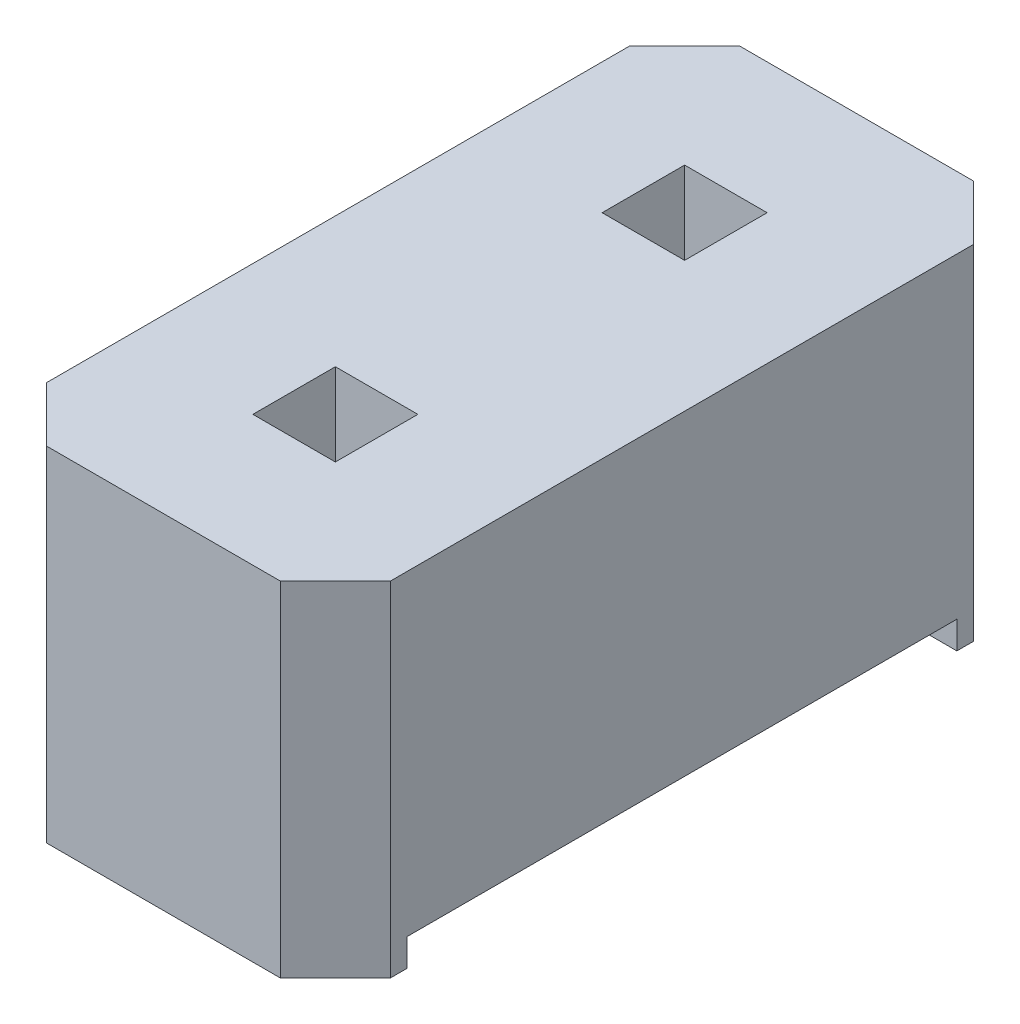
ISO-10303-21;
HEADER;
FILE_DESCRIPTION(('STEP AP214'),'2;1');
FILE_NAME('part.step','',(''),(''),'','','');
FILE_SCHEMA(('AUTOMOTIVE_DESIGN { 1 0 10303 214 1 1 1 1 }'));
ENDSEC;
DATA;
#1=APPLICATION_CONTEXT('core data for automotive mechanical design processes');
#2=APPLICATION_PROTOCOL_DEFINITION('international standard','automotive_design',2000,#1);
#3=PRODUCT_CONTEXT('',#1,'mechanical');
#4=PRODUCT('Part','Part','',(#3));
#5=PRODUCT_RELATED_PRODUCT_CATEGORY('part','',(#4));
#6=PRODUCT_DEFINITION_FORMATION('','',#4);
#7=PRODUCT_DEFINITION_CONTEXT('part definition',#1,'design');
#8=PRODUCT_DEFINITION('design','',#6,#7);
#9=PRODUCT_DEFINITION_SHAPE('','',#8);
#10=(LENGTH_UNIT() NAMED_UNIT(*) SI_UNIT(.MILLI.,.METRE.));
#11=(NAMED_UNIT(*) PLANE_ANGLE_UNIT() SI_UNIT($,.RADIAN.));
#12=(NAMED_UNIT(*) SI_UNIT($,.STERADIAN.) SOLID_ANGLE_UNIT());
#13=UNCERTAINTY_MEASURE_WITH_UNIT(LENGTH_MEASURE(1.E-05),#10,'distance_accuracy_value','');
#14=(GEOMETRIC_REPRESENTATION_CONTEXT(3) GLOBAL_UNCERTAINTY_ASSIGNED_CONTEXT((#13)) GLOBAL_UNIT_ASSIGNED_CONTEXT((#10,
#11,#12)) REPRESENTATION_CONTEXT('',''));
#15=CARTESIAN_POINT('',(0.,0.,0.));
#16=DIRECTION('',(0.,0.,1.));
#17=DIRECTION('',(1.,0.,0.));
#18=AXIS2_PLACEMENT_3D('',#15,#16,#17);
#19=CARTESIAN_POINT('',(0.,0.,0.));
#20=DIRECTION('',(0.,-1.,0.));
#21=DIRECTION('',(0.,0.,-1.));
#22=AXIS2_PLACEMENT_3D('',#19,#20,#21);
#23=PLANE('',#22);
#24=DIRECTION('',(-1.,0.,0.));
#25=VECTOR('',#24,1.);
#26=CARTESIAN_POINT('',(0.,0.,2.));
#27=LINE('',#26,#25);
#28=CARTESIAN_POINT('',(1.25,0.,2.));
#29=VERTEX_POINT('',#28);
#30=CARTESIAN_POINT('',(-1.25,0.,2.));
#31=VERTEX_POINT('',#30);
#32=EDGE_CURVE('E340',#29,#31,#27,.T.);
#33=ORIENTED_EDGE('',*,*,#32,.F.);
#34=DIRECTION('',(0.,0.,-1.));
#35=VECTOR('',#34,1.);
#36=CARTESIAN_POINT('',(1.25,0.,2.12));
#37=LINE('',#36,#35);
#38=CARTESIAN_POINT('',(1.25,0.,2.12));
#39=VERTEX_POINT('',#38);
#40=EDGE_CURVE('E190',#39,#29,#37,.T.);
#41=ORIENTED_EDGE('',*,*,#40,.F.);
#42=DIRECTION('',(0.707106781186547,0.,-0.707106781186548));
#43=VECTOR('',#42,1.);
#44=CARTESIAN_POINT('',(0.850000000000001,0.,2.52));
#45=LINE('',#44,#43);
#46=CARTESIAN_POINT('',(0.850000000000001,0.,2.52));
#47=VERTEX_POINT('',#46);
#48=EDGE_CURVE('E201',#47,#39,#45,.T.);
#49=ORIENTED_EDGE('',*,*,#48,.F.);
#50=DIRECTION('',(1.,0.,0.));
#51=VECTOR('',#50,1.);
#52=CARTESIAN_POINT('',(-0.85,0.,2.52));
#53=LINE('',#52,#51);
#54=CARTESIAN_POINT('',(-0.85,0.,2.52));
#55=VERTEX_POINT('',#54);
#56=EDGE_CURVE('E307',#55,#47,#53,.T.);
#57=ORIENTED_EDGE('',*,*,#56,.F.);
#58=DIRECTION('',(0.707106781186547,0.,0.707106781186548));
#59=VECTOR('',#58,1.);
#60=CARTESIAN_POINT('',(-1.25,0.,2.12));
#61=LINE('',#60,#59);
#62=CARTESIAN_POINT('',(-1.25,0.,2.12));
#63=VERTEX_POINT('',#62);
#64=EDGE_CURVE('E306',#63,#55,#61,.T.);
#65=ORIENTED_EDGE('',*,*,#64,.F.);
#66=DIRECTION('',(0.,0.,1.));
#67=VECTOR('',#66,1.);
#68=CARTESIAN_POINT('',(-1.25,0.,2.12));
#69=LINE('',#68,#67);
#70=EDGE_CURVE('E287',#31,#63,#69,.T.);
#71=ORIENTED_EDGE('',*,*,#70,.F.);
#72=EDGE_LOOP('',(#33,#41,#49,#57,#65,#71));
#73=FACE_BOUND('',#72,.T.);
#74=ADVANCED_FACE('F33',(#73),#23,.T.);
#75=CARTESIAN_POINT('',(0.,2.5,0.));
#76=DIRECTION('',(0.,-1.,0.));
#77=DIRECTION('',(0.,0.,-1.));
#78=AXIS2_PLACEMENT_3D('',#75,#76,#77);
#79=PLANE('',#78);
#80=DIRECTION('',(0.,0.,1.));
#81=VECTOR('',#80,1.);
#82=CARTESIAN_POINT('',(-0.3,2.5,0.97));
#83=LINE('',#82,#81);
#84=CARTESIAN_POINT('',(-0.3,2.5,0.97));
#85=VERTEX_POINT('',#84);
#86=CARTESIAN_POINT('',(-0.3,2.5,1.57));
#87=VERTEX_POINT('',#86);
#88=EDGE_CURVE('E266',#85,#87,#83,.T.);
#89=ORIENTED_EDGE('',*,*,#88,.F.);
#90=DIRECTION('',(-1.,0.,0.));
#91=VECTOR('',#90,1.);
#92=CARTESIAN_POINT('',(0.3,2.5,0.97));
#93=LINE('',#92,#91);
#94=CARTESIAN_POINT('',(0.3,2.5,0.97));
#95=VERTEX_POINT('',#94);
#96=EDGE_CURVE('E273',#95,#85,#93,.T.);
#97=ORIENTED_EDGE('',*,*,#96,.F.);
#98=DIRECTION('',(0.,0.,-1.));
#99=VECTOR('',#98,1.);
#100=CARTESIAN_POINT('',(0.3,2.5,0.97));
#101=LINE('',#100,#99);
#102=CARTESIAN_POINT('',(0.3,2.5,1.57));
#103=VERTEX_POINT('',#102);
#104=EDGE_CURVE('E270',#103,#95,#101,.T.);
#105=ORIENTED_EDGE('',*,*,#104,.F.);
#106=DIRECTION('',(1.,0.,0.));
#107=VECTOR('',#106,1.);
#108=CARTESIAN_POINT('',(0.3,2.5,1.57));
#109=LINE('',#108,#107);
#110=EDGE_CURVE('E268',#87,#103,#109,.T.);
#111=ORIENTED_EDGE('',*,*,#110,.F.);
#112=EDGE_LOOP('',(#89,#97,#105,#111));
#113=FACE_BOUND('',#112,.T.);
#114=DIRECTION('',(0.,0.,1.));
#115=VECTOR('',#114,1.);
#116=CARTESIAN_POINT('',(-1.25,2.5,2.12));
#117=LINE('',#116,#115);
#118=CARTESIAN_POINT('',(-1.25,2.5,-2.12));
#119=VERTEX_POINT('',#118);
#120=CARTESIAN_POINT('',(-1.25,2.5,2.12));
#121=VERTEX_POINT('',#120);
#122=EDGE_CURVE('E208',#119,#121,#117,.T.);
#123=ORIENTED_EDGE('',*,*,#122,.T.);
#124=DIRECTION('',(0.707106781186547,0.,0.707106781186548));
#125=VECTOR('',#124,1.);
#126=CARTESIAN_POINT('',(-1.25,2.5,2.12));
#127=LINE('',#126,#125);
#128=CARTESIAN_POINT('',(-0.85,2.5,2.52));
#129=VERTEX_POINT('',#128);
#130=EDGE_CURVE('E290',#121,#129,#127,.T.);
#131=ORIENTED_EDGE('',*,*,#130,.T.);
#132=DIRECTION('',(1.,0.,0.));
#133=VECTOR('',#132,1.);
#134=CARTESIAN_POINT('',(-0.85,2.5,2.52));
#135=LINE('',#134,#133);
#136=CARTESIAN_POINT('',(0.850000000000001,2.5,2.52));
#137=VERTEX_POINT('',#136);
#138=EDGE_CURVE('E292',#129,#137,#135,.T.);
#139=ORIENTED_EDGE('',*,*,#138,.T.);
#140=DIRECTION('',(0.707106781186547,0.,-0.707106781186548));
#141=VECTOR('',#140,1.);
#142=CARTESIAN_POINT('',(0.850000000000001,2.5,2.52));
#143=LINE('',#142,#141);
#144=CARTESIAN_POINT('',(1.25,2.5,2.12));
#145=VERTEX_POINT('',#144);
#146=EDGE_CURVE('E294',#137,#145,#143,.T.);
#147=ORIENTED_EDGE('',*,*,#146,.T.);
#148=DIRECTION('',(0.,0.,-1.));
#149=VECTOR('',#148,1.);
#150=CARTESIAN_POINT('',(1.25,2.5,2.12));
#151=LINE('',#150,#149);
#152=CARTESIAN_POINT('',(1.25,2.5,-2.12));
#153=VERTEX_POINT('',#152);
#154=EDGE_CURVE('E296',#145,#153,#151,.T.);
#155=ORIENTED_EDGE('',*,*,#154,.T.);
#156=DIRECTION('',(-0.707106781186547,0.,-0.707106781186548));
#157=VECTOR('',#156,1.);
#158=CARTESIAN_POINT('',(0.85,2.5,-2.52));
#159=LINE('',#158,#157);
#160=CARTESIAN_POINT('',(0.85,2.5,-2.52));
#161=VERTEX_POINT('',#160);
#162=EDGE_CURVE('E298',#153,#161,#159,.T.);
#163=ORIENTED_EDGE('',*,*,#162,.T.);
#164=DIRECTION('',(-1.,0.,0.));
#165=VECTOR('',#164,1.);
#166=CARTESIAN_POINT('',(-0.85,2.5,-2.52));
#167=LINE('',#166,#165);
#168=CARTESIAN_POINT('',(-0.85,2.5,-2.52));
#169=VERTEX_POINT('',#168);
#170=EDGE_CURVE('E300',#161,#169,#167,.T.);
#171=ORIENTED_EDGE('',*,*,#170,.T.);
#172=DIRECTION('',(-0.707106781186547,0.,0.707106781186548));
#173=VECTOR('',#172,1.);
#174=CARTESIAN_POINT('',(-1.25,2.5,-2.12));
#175=LINE('',#174,#173);
#176=EDGE_CURVE('E213',#169,#119,#175,.T.);
#177=ORIENTED_EDGE('',*,*,#176,.T.);
#178=EDGE_LOOP('',(#123,#131,#139,#147,#155,#163,#171,#177));
#179=FACE_BOUND('',#178,.T.);
#180=DIRECTION('',(1.,0.,0.));
#181=VECTOR('',#180,1.);
#182=CARTESIAN_POINT('',(0.3,2.5,-0.97));
#183=LINE('',#182,#181);
#184=CARTESIAN_POINT('',(-0.3,2.5,-0.97));
#185=VERTEX_POINT('',#184);
#186=CARTESIAN_POINT('',(0.3,2.5,-0.97));
#187=VERTEX_POINT('',#186);
#188=EDGE_CURVE('E342',#185,#187,#183,.T.);
#189=ORIENTED_EDGE('',*,*,#188,.F.);
#190=DIRECTION('',(0.,0.,1.));
#191=VECTOR('',#190,1.);
#192=CARTESIAN_POINT('',(-0.3,2.5,-0.97));
#193=LINE('',#192,#191);
#194=CARTESIAN_POINT('',(-0.3,2.5,-1.57));
#195=VERTEX_POINT('',#194);
#196=EDGE_CURVE('E254',#195,#185,#193,.T.);
#197=ORIENTED_EDGE('',*,*,#196,.F.);
#198=DIRECTION('',(-1.,0.,0.));
#199=VECTOR('',#198,1.);
#200=CARTESIAN_POINT('',(0.3,2.5,-1.57));
#201=LINE('',#200,#199);
#202=CARTESIAN_POINT('',(0.3,2.5,-1.57));
#203=VERTEX_POINT('',#202);
#204=EDGE_CURVE('E259',#203,#195,#201,.T.);
#205=ORIENTED_EDGE('',*,*,#204,.F.);
#206=DIRECTION('',(0.,0.,-1.));
#207=VECTOR('',#206,1.);
#208=CARTESIAN_POINT('',(0.3,2.5,-0.97));
#209=LINE('',#208,#207);
#210=EDGE_CURVE('E344',#187,#203,#209,.T.);
#211=ORIENTED_EDGE('',*,*,#210,.F.);
#212=EDGE_LOOP('',(#189,#197,#205,#211));
#213=FACE_BOUND('',#212,.T.);
#214=ADVANCED_FACE('F352',(#113,#179,#213),#79,.F.);
#215=DIRECTION('',(1.,0.,0.));
#216=VECTOR('',#215,1.);
#217=CARTESIAN_POINT('',(0.,0.,-2.));
#218=LINE('',#217,#216);
#219=CARTESIAN_POINT('',(-1.25,0.,-2.));
#220=VERTEX_POINT('',#219);
#221=CARTESIAN_POINT('',(1.25,0.,-2.));
#222=VERTEX_POINT('',#221);
#223=EDGE_CURVE('E338',#220,#222,#218,.T.);
#224=ORIENTED_EDGE('',*,*,#223,.F.);
#225=CARTESIAN_POINT('',(-1.25,0.,-2.12));
#226=VERTEX_POINT('',#225);
#227=EDGE_CURVE('E303',#226,#220,#69,.T.);
#228=ORIENTED_EDGE('',*,*,#227,.F.);
#229=DIRECTION('',(-0.707106781186547,0.,0.707106781186548));
#230=VECTOR('',#229,1.);
#231=CARTESIAN_POINT('',(-1.25,0.,-2.12));
#232=LINE('',#231,#230);
#233=CARTESIAN_POINT('',(-0.85,0.,-2.52));
#234=VERTEX_POINT('',#233);
#235=EDGE_CURVE('E206',#234,#226,#232,.T.);
#236=ORIENTED_EDGE('',*,*,#235,.F.);
#237=DIRECTION('',(-1.,0.,0.));
#238=VECTOR('',#237,1.);
#239=CARTESIAN_POINT('',(-0.85,0.,-2.52));
#240=LINE('',#239,#238);
#241=CARTESIAN_POINT('',(0.85,0.,-2.52));
#242=VERTEX_POINT('',#241);
#243=EDGE_CURVE('E199',#242,#234,#240,.T.);
#244=ORIENTED_EDGE('',*,*,#243,.F.);
#245=DIRECTION('',(-0.707106781186547,0.,-0.707106781186548));
#246=VECTOR('',#245,1.);
#247=CARTESIAN_POINT('',(0.85,0.,-2.52));
#248=LINE('',#247,#246);
#249=CARTESIAN_POINT('',(1.25,0.,-2.12));
#250=VERTEX_POINT('',#249);
#251=EDGE_CURVE('E196',#250,#242,#248,.T.);
#252=ORIENTED_EDGE('',*,*,#251,.F.);
#253=EDGE_CURVE('E197',#222,#250,#37,.T.);
#254=ORIENTED_EDGE('',*,*,#253,.F.);
#255=EDGE_LOOP('',(#224,#228,#236,#244,#252,#254));
#256=FACE_BOUND('',#255,.T.);
#257=ADVANCED_FACE('F366',(#256),#23,.T.);
#258=CARTESIAN_POINT('',(-1.25,2.5,2.12));
#259=DIRECTION('',(1.,0.,0.));
#260=DIRECTION('',(0.,0.,-1.));
#261=AXIS2_PLACEMENT_3D('',#258,#259,#260);
#262=PLANE('',#261);
#263=DIRECTION('',(0.,0.,-1.));
#264=VECTOR('',#263,1.);
#265=CARTESIAN_POINT('',(-1.25,0.2,-2.));
#266=LINE('',#265,#264);
#267=CARTESIAN_POINT('',(-1.25,0.2,2.));
#268=VERTEX_POINT('',#267);
#269=CARTESIAN_POINT('',(-1.25,0.2,-2.));
#270=VERTEX_POINT('',#269);
#271=EDGE_CURVE('E323',#268,#270,#266,.T.);
#272=ORIENTED_EDGE('',*,*,#271,.F.);
#273=DIRECTION('',(0.,1.,0.));
#274=VECTOR('',#273,1.);
#275=CARTESIAN_POINT('',(-1.25,-0.2,2.));
#276=LINE('',#275,#274);
#277=EDGE_CURVE('E174',#31,#268,#276,.T.);
#278=ORIENTED_EDGE('',*,*,#277,.F.);
#279=ORIENTED_EDGE('',*,*,#70,.T.);
#280=DIRECTION('',(0.,-1.,0.));
#281=VECTOR('',#280,1.);
#282=CARTESIAN_POINT('',(-1.25,2.5,2.12));
#283=LINE('',#282,#281);
#284=EDGE_CURVE('E229',#121,#63,#283,.T.);
#285=ORIENTED_EDGE('',*,*,#284,.F.);
#286=ORIENTED_EDGE('',*,*,#122,.F.);
#287=DIRECTION('',(0.,-1.,0.));
#288=VECTOR('',#287,1.);
#289=CARTESIAN_POINT('',(-1.25,2.5,-2.12));
#290=LINE('',#289,#288);
#291=EDGE_CURVE('E209',#119,#226,#290,.T.);
#292=ORIENTED_EDGE('',*,*,#291,.T.);
#293=ORIENTED_EDGE('',*,*,#227,.T.);
#294=DIRECTION('',(0.,-1.,0.));
#295=VECTOR('',#294,1.);
#296=CARTESIAN_POINT('',(-1.25,-0.2,-2.));
#297=LINE('',#296,#295);
#298=EDGE_CURVE('E184',#270,#220,#297,.T.);
#299=ORIENTED_EDGE('',*,*,#298,.F.);
#300=EDGE_LOOP('',(#272,#278,#279,#285,#286,#292,#293,#299));
#301=FACE_BOUND('',#300,.T.);
#302=ADVANCED_FACE('F35',(#301),#262,.F.);
#303=CARTESIAN_POINT('',(-1.25,2.5,2.12));
#304=DIRECTION('',(0.707106781186548,0.,-0.707106781186547));
#305=DIRECTION('',(-0.707106781186547,0.,-0.707106781186548));
#306=AXIS2_PLACEMENT_3D('',#303,#304,#305);
#307=PLANE('',#306);
#308=ORIENTED_EDGE('',*,*,#64,.T.);
#309=DIRECTION('',(0.,-1.,0.));
#310=VECTOR('',#309,1.);
#311=CARTESIAN_POINT('',(-0.85,2.5,2.52));
#312=LINE('',#311,#310);
#313=EDGE_CURVE('E226',#129,#55,#312,.T.);
#314=ORIENTED_EDGE('',*,*,#313,.F.);
#315=ORIENTED_EDGE('',*,*,#130,.F.);
#316=ORIENTED_EDGE('',*,*,#284,.T.);
#317=EDGE_LOOP('',(#308,#314,#315,#316));
#318=FACE_BOUND('',#317,.T.);
#319=ADVANCED_FACE('F319',(#318),#307,.F.);
#320=CARTESIAN_POINT('',(-0.85,2.5,2.52));
#321=DIRECTION('',(0.,0.,-1.));
#322=DIRECTION('',(-1.,0.,0.));
#323=AXIS2_PLACEMENT_3D('',#320,#321,#322);
#324=PLANE('',#323);
#325=ORIENTED_EDGE('',*,*,#56,.T.);
#326=DIRECTION('',(0.,-1.,0.));
#327=VECTOR('',#326,1.);
#328=CARTESIAN_POINT('',(0.850000000000001,2.5,2.52));
#329=LINE('',#328,#327);
#330=EDGE_CURVE('E223',#137,#47,#329,.T.);
#331=ORIENTED_EDGE('',*,*,#330,.F.);
#332=ORIENTED_EDGE('',*,*,#138,.F.);
#333=ORIENTED_EDGE('',*,*,#313,.T.);
#334=EDGE_LOOP('',(#325,#331,#332,#333));
#335=FACE_BOUND('',#334,.T.);
#336=ADVANCED_FACE('F399',(#335),#324,.F.);
#337=CARTESIAN_POINT('',(0.850000000000001,2.5,2.52));
#338=DIRECTION('',(-0.707106781186548,0.,-0.707106781186547));
#339=DIRECTION('',(-0.707106781186547,0.,0.707106781186548));
#340=AXIS2_PLACEMENT_3D('',#337,#338,#339);
#341=PLANE('',#340);
#342=ORIENTED_EDGE('',*,*,#48,.T.);
#343=DIRECTION('',(0.,-1.,0.));
#344=VECTOR('',#343,1.);
#345=CARTESIAN_POINT('',(1.25,2.5,2.12));
#346=LINE('',#345,#344);
#347=EDGE_CURVE('E193',#145,#39,#346,.T.);
#348=ORIENTED_EDGE('',*,*,#347,.F.);
#349=ORIENTED_EDGE('',*,*,#146,.F.);
#350=ORIENTED_EDGE('',*,*,#330,.T.);
#351=EDGE_LOOP('',(#342,#348,#349,#350));
#352=FACE_BOUND('',#351,.T.);
#353=ADVANCED_FACE('F312',(#352),#341,.F.);
#354=CARTESIAN_POINT('',(1.25,2.5,2.12));
#355=DIRECTION('',(-1.,0.,0.));
#356=DIRECTION('',(0.,0.,1.));
#357=AXIS2_PLACEMENT_3D('',#354,#355,#356);
#358=PLANE('',#357);
#359=ORIENTED_EDGE('',*,*,#40,.T.);
#360=DIRECTION('',(0.,1.,0.));
#361=VECTOR('',#360,1.);
#362=CARTESIAN_POINT('',(1.25,2.5,2.));
#363=LINE('',#362,#361);
#364=CARTESIAN_POINT('',(1.25,0.2,2.));
#365=VERTEX_POINT('',#364);
#366=EDGE_CURVE('E11',#29,#365,#363,.T.);
#367=ORIENTED_EDGE('',*,*,#366,.T.);
#368=DIRECTION('',(0.,0.,-1.));
#369=VECTOR('',#368,1.);
#370=CARTESIAN_POINT('',(1.25,0.2,-2.));
#371=LINE('',#370,#369);
#372=CARTESIAN_POINT('',(1.25,0.2,-2.));
#373=VERTEX_POINT('',#372);
#374=EDGE_CURVE('E181',#365,#373,#371,.T.);
#375=ORIENTED_EDGE('',*,*,#374,.T.);
#376=DIRECTION('',(0.,-1.,0.));
#377=VECTOR('',#376,1.);
#378=CARTESIAN_POINT('',(1.25,-0.2,-2.));
#379=LINE('',#378,#377);
#380=EDGE_CURVE('E48',#373,#222,#379,.T.);
#381=ORIENTED_EDGE('',*,*,#380,.T.);
#382=ORIENTED_EDGE('',*,*,#253,.T.);
#383=DIRECTION('',(0.,-1.,0.));
#384=VECTOR('',#383,1.);
#385=CARTESIAN_POINT('',(1.25,2.5,-2.12));
#386=LINE('',#385,#384);
#387=EDGE_CURVE('E219',#153,#250,#386,.T.);
#388=ORIENTED_EDGE('',*,*,#387,.F.);
#389=ORIENTED_EDGE('',*,*,#154,.F.);
#390=ORIENTED_EDGE('',*,*,#347,.T.);
#391=EDGE_LOOP('',(#359,#367,#375,#381,#382,#388,#389,#390));
#392=FACE_BOUND('',#391,.T.);
#393=ADVANCED_FACE('F187',(#392),#358,.F.);
#394=CARTESIAN_POINT('',(0.85,2.5,-2.52));
#395=DIRECTION('',(-0.707106781186548,0.,0.707106781186547));
#396=DIRECTION('',(0.707106781186547,0.,0.707106781186548));
#397=AXIS2_PLACEMENT_3D('',#394,#395,#396);
#398=PLANE('',#397);
#399=ORIENTED_EDGE('',*,*,#251,.T.);
#400=DIRECTION('',(0.,-1.,0.));
#401=VECTOR('',#400,1.);
#402=CARTESIAN_POINT('',(0.85,2.5,-2.52));
#403=LINE('',#402,#401);
#404=EDGE_CURVE('E216',#161,#242,#403,.T.);
#405=ORIENTED_EDGE('',*,*,#404,.F.);
#406=ORIENTED_EDGE('',*,*,#162,.F.);
#407=ORIENTED_EDGE('',*,*,#387,.T.);
#408=EDGE_LOOP('',(#399,#405,#406,#407));
#409=FACE_BOUND('',#408,.T.);
#410=ADVANCED_FACE('F395',(#409),#398,.F.);
#411=CARTESIAN_POINT('',(-0.85,2.5,-2.52));
#412=DIRECTION('',(0.,0.,1.));
#413=DIRECTION('',(1.,0.,0.));
#414=AXIS2_PLACEMENT_3D('',#411,#412,#413);
#415=PLANE('',#414);
#416=ORIENTED_EDGE('',*,*,#243,.T.);
#417=DIRECTION('',(0.,-1.,0.));
#418=VECTOR('',#417,1.);
#419=CARTESIAN_POINT('',(-0.85,2.5,-2.52));
#420=LINE('',#419,#418);
#421=EDGE_CURVE('E212',#169,#234,#420,.T.);
#422=ORIENTED_EDGE('',*,*,#421,.F.);
#423=ORIENTED_EDGE('',*,*,#170,.F.);
#424=ORIENTED_EDGE('',*,*,#404,.T.);
#425=EDGE_LOOP('',(#416,#422,#423,#424));
#426=FACE_BOUND('',#425,.T.);
#427=ADVANCED_FACE('F390',(#426),#415,.F.);
#428=CARTESIAN_POINT('',(-1.25,2.5,-2.12));
#429=DIRECTION('',(0.707106781186548,0.,0.707106781186547));
#430=DIRECTION('',(0.707106781186547,0.,-0.707106781186548));
#431=AXIS2_PLACEMENT_3D('',#428,#429,#430);
#432=PLANE('',#431);
#433=ORIENTED_EDGE('',*,*,#235,.T.);
#434=ORIENTED_EDGE('',*,*,#291,.F.);
#435=ORIENTED_EDGE('',*,*,#176,.F.);
#436=ORIENTED_EDGE('',*,*,#421,.T.);
#437=EDGE_LOOP('',(#433,#434,#435,#436));
#438=FACE_BOUND('',#437,.T.);
#439=ADVANCED_FACE('F386',(#438),#432,.F.);
#440=CARTESIAN_POINT('',(-0.3,2.5,0.97));
#441=DIRECTION('',(1.,0.,0.));
#442=DIRECTION('',(0.,0.,-1.));
#443=AXIS2_PLACEMENT_3D('',#440,#441,#442);
#444=PLANE('',#443);
#445=DIRECTION('',(0.,0.,1.));
#446=VECTOR('',#445,1.);
#447=CARTESIAN_POINT('',(-0.3,0.2,0.97));
#448=LINE('',#447,#446);
#449=CARTESIAN_POINT('',(-0.3,0.2,0.97));
#450=VERTEX_POINT('',#449);
#451=CARTESIAN_POINT('',(-0.3,0.2,1.57));
#452=VERTEX_POINT('',#451);
#453=EDGE_CURVE('E336',#450,#452,#448,.T.);
#454=ORIENTED_EDGE('',*,*,#453,.F.);
#455=DIRECTION('',(0.,-1.,0.));
#456=VECTOR('',#455,1.);
#457=CARTESIAN_POINT('',(-0.3,2.5,0.97));
#458=LINE('',#457,#456);
#459=EDGE_CURVE('E275',#85,#450,#458,.T.);
#460=ORIENTED_EDGE('',*,*,#459,.F.);
#461=ORIENTED_EDGE('',*,*,#88,.T.);
#462=DIRECTION('',(0.,-1.,0.));
#463=VECTOR('',#462,1.);
#464=CARTESIAN_POINT('',(-0.3,2.5,1.57));
#465=LINE('',#464,#463);
#466=EDGE_CURVE('E284',#87,#452,#465,.T.);
#467=ORIENTED_EDGE('',*,*,#466,.T.);
#468=EDGE_LOOP('',(#454,#460,#461,#467));
#469=FACE_BOUND('',#468,.T.);
#470=ADVANCED_FACE('F414',(#469),#444,.T.);
#471=CARTESIAN_POINT('',(0.3,2.5,1.57));
#472=DIRECTION('',(0.,0.,-1.));
#473=DIRECTION('',(-1.,0.,0.));
#474=AXIS2_PLACEMENT_3D('',#471,#472,#473);
#475=PLANE('',#474);
#476=DIRECTION('',(1.,0.,0.));
#477=VECTOR('',#476,1.);
#478=CARTESIAN_POINT('',(0.3,0.2,1.57));
#479=LINE('',#478,#477);
#480=CARTESIAN_POINT('',(0.3,0.2,1.57));
#481=VERTEX_POINT('',#480);
#482=EDGE_CURVE('E334',#452,#481,#479,.T.);
#483=ORIENTED_EDGE('',*,*,#482,.F.);
#484=ORIENTED_EDGE('',*,*,#466,.F.);
#485=ORIENTED_EDGE('',*,*,#110,.T.);
#486=DIRECTION('',(0.,-1.,0.));
#487=VECTOR('',#486,1.);
#488=CARTESIAN_POINT('',(0.3,2.5,1.57));
#489=LINE('',#488,#487);
#490=EDGE_CURVE('E281',#103,#481,#489,.T.);
#491=ORIENTED_EDGE('',*,*,#490,.T.);
#492=EDGE_LOOP('',(#483,#484,#485,#491));
#493=FACE_BOUND('',#492,.T.);
#494=ADVANCED_FACE('F418',(#493),#475,.T.);
#495=CARTESIAN_POINT('',(0.3,2.5,0.97));
#496=DIRECTION('',(-1.,0.,0.));
#497=DIRECTION('',(0.,0.,1.));
#498=AXIS2_PLACEMENT_3D('',#495,#496,#497);
#499=PLANE('',#498);
#500=DIRECTION('',(0.,0.,-1.));
#501=VECTOR('',#500,1.);
#502=CARTESIAN_POINT('',(0.3,0.2,0.97));
#503=LINE('',#502,#501);
#504=CARTESIAN_POINT('',(0.3,0.2,0.97));
#505=VERTEX_POINT('',#504);
#506=EDGE_CURVE('E56',#481,#505,#503,.T.);
#507=ORIENTED_EDGE('',*,*,#506,.F.);
#508=ORIENTED_EDGE('',*,*,#490,.F.);
#509=ORIENTED_EDGE('',*,*,#104,.T.);
#510=DIRECTION('',(0.,-1.,0.));
#511=VECTOR('',#510,1.);
#512=CARTESIAN_POINT('',(0.3,2.5,0.97));
#513=LINE('',#512,#511);
#514=EDGE_CURVE('E278',#95,#505,#513,.T.);
#515=ORIENTED_EDGE('',*,*,#514,.T.);
#516=EDGE_LOOP('',(#507,#508,#509,#515));
#517=FACE_BOUND('',#516,.T.);
#518=ADVANCED_FACE('F424',(#517),#499,.T.);
#519=CARTESIAN_POINT('',(0.3,2.5,0.97));
#520=DIRECTION('',(0.,0.,1.));
#521=DIRECTION('',(1.,0.,0.));
#522=AXIS2_PLACEMENT_3D('',#519,#520,#521);
#523=PLANE('',#522);
#524=DIRECTION('',(-1.,0.,0.));
#525=VECTOR('',#524,1.);
#526=CARTESIAN_POINT('',(0.3,0.2,0.97));
#527=LINE('',#526,#525);
#528=EDGE_CURVE('E249',#505,#450,#527,.T.);
#529=ORIENTED_EDGE('',*,*,#528,.F.);
#530=ORIENTED_EDGE('',*,*,#514,.F.);
#531=ORIENTED_EDGE('',*,*,#96,.T.);
#532=ORIENTED_EDGE('',*,*,#459,.T.);
#533=EDGE_LOOP('',(#529,#530,#531,#532));
#534=FACE_BOUND('',#533,.T.);
#535=ADVANCED_FACE('F362',(#534),#523,.T.);
#536=CARTESIAN_POINT('',(0.3,2.5,-0.97));
#537=DIRECTION('',(0.,0.,-1.));
#538=DIRECTION('',(-1.,0.,0.));
#539=AXIS2_PLACEMENT_3D('',#536,#537,#538);
#540=PLANE('',#539);
#541=DIRECTION('',(1.,0.,0.));
#542=VECTOR('',#541,1.);
#543=CARTESIAN_POINT('',(0.3,0.2,-0.97));
#544=LINE('',#543,#542);
#545=CARTESIAN_POINT('',(-0.3,0.2,-0.97));
#546=VERTEX_POINT('',#545);
#547=CARTESIAN_POINT('',(0.3,0.2,-0.97));
#548=VERTEX_POINT('',#547);
#549=EDGE_CURVE('E234',#546,#548,#544,.T.);
#550=ORIENTED_EDGE('',*,*,#549,.F.);
#551=DIRECTION('',(0.,-1.,0.));
#552=VECTOR('',#551,1.);
#553=CARTESIAN_POINT('',(-0.3,2.5,-0.97));
#554=LINE('',#553,#552);
#555=EDGE_CURVE('E245',#185,#546,#554,.T.);
#556=ORIENTED_EDGE('',*,*,#555,.F.);
#557=ORIENTED_EDGE('',*,*,#188,.T.);
#558=DIRECTION('',(0.,-1.,0.));
#559=VECTOR('',#558,1.);
#560=CARTESIAN_POINT('',(0.3,2.5,-0.97));
#561=LINE('',#560,#559);
#562=EDGE_CURVE('E248',#187,#548,#561,.T.);
#563=ORIENTED_EDGE('',*,*,#562,.T.);
#564=EDGE_LOOP('',(#550,#556,#557,#563));
#565=FACE_BOUND('',#564,.T.);
#566=ADVANCED_FACE('F244',(#565),#540,.T.);
#567=CARTESIAN_POINT('',(0.3,2.5,-0.97));
#568=DIRECTION('',(-1.,0.,0.));
#569=DIRECTION('',(0.,0.,1.));
#570=AXIS2_PLACEMENT_3D('',#567,#568,#569);
#571=PLANE('',#570);
#572=DIRECTION('',(0.,0.,-1.));
#573=VECTOR('',#572,1.);
#574=CARTESIAN_POINT('',(0.3,0.2,-0.97));
#575=LINE('',#574,#573);
#576=CARTESIAN_POINT('',(0.3,0.2,-1.57));
#577=VERTEX_POINT('',#576);
#578=EDGE_CURVE('E250',#548,#577,#575,.T.);
#579=ORIENTED_EDGE('',*,*,#578,.F.);
#580=ORIENTED_EDGE('',*,*,#562,.F.);
#581=ORIENTED_EDGE('',*,*,#210,.T.);
#582=DIRECTION('',(0.,-1.,0.));
#583=VECTOR('',#582,1.);
#584=CARTESIAN_POINT('',(0.3,2.5,-1.57));
#585=LINE('',#584,#583);
#586=EDGE_CURVE('E257',#203,#577,#585,.T.);
#587=ORIENTED_EDGE('',*,*,#586,.T.);
#588=EDGE_LOOP('',(#579,#580,#581,#587));
#589=FACE_BOUND('',#588,.T.);
#590=ADVANCED_FACE('F354',(#589),#571,.T.);
#591=CARTESIAN_POINT('',(0.3,2.5,-1.57));
#592=DIRECTION('',(0.,0.,1.));
#593=DIRECTION('',(1.,0.,0.));
#594=AXIS2_PLACEMENT_3D('',#591,#592,#593);
#595=PLANE('',#594);
#596=DIRECTION('',(-1.,0.,0.));
#597=VECTOR('',#596,1.);
#598=CARTESIAN_POINT('',(0.3,0.2,-1.57));
#599=LINE('',#598,#597);
#600=CARTESIAN_POINT('',(-0.3,0.2,-1.57));
#601=VERTEX_POINT('',#600);
#602=EDGE_CURVE('E237',#577,#601,#599,.T.);
#603=ORIENTED_EDGE('',*,*,#602,.F.);
#604=ORIENTED_EDGE('',*,*,#586,.F.);
#605=ORIENTED_EDGE('',*,*,#204,.T.);
#606=DIRECTION('',(0.,-1.,0.));
#607=VECTOR('',#606,1.);
#608=CARTESIAN_POINT('',(-0.3,2.5,-1.57));
#609=LINE('',#608,#607);
#610=EDGE_CURVE('E255',#195,#601,#609,.T.);
#611=ORIENTED_EDGE('',*,*,#610,.T.);
#612=EDGE_LOOP('',(#603,#604,#605,#611));
#613=FACE_BOUND('',#612,.T.);
#614=ADVANCED_FACE('F349',(#613),#595,.T.);
#615=CARTESIAN_POINT('',(-0.3,2.5,-0.97));
#616=DIRECTION('',(1.,0.,0.));
#617=DIRECTION('',(0.,0.,-1.));
#618=AXIS2_PLACEMENT_3D('',#615,#616,#617);
#619=PLANE('',#618);
#620=DIRECTION('',(0.,0.,1.));
#621=VECTOR('',#620,1.);
#622=CARTESIAN_POINT('',(-0.3,0.2,-0.97));
#623=LINE('',#622,#621);
#624=EDGE_CURVE('E41',#601,#546,#623,.T.);
#625=ORIENTED_EDGE('',*,*,#624,.F.);
#626=ORIENTED_EDGE('',*,*,#610,.F.);
#627=ORIENTED_EDGE('',*,*,#196,.T.);
#628=ORIENTED_EDGE('',*,*,#555,.T.);
#629=EDGE_LOOP('',(#625,#626,#627,#628));
#630=FACE_BOUND('',#629,.T.);
#631=ADVANCED_FACE('F252',(#630),#619,.T.);
#632=CARTESIAN_POINT('',(1.25,-0.2,2.));
#633=DIRECTION('',(0.,0.,1.));
#634=DIRECTION('',(1.,0.,0.));
#635=AXIS2_PLACEMENT_3D('',#632,#633,#634);
#636=PLANE('',#635);
#637=ORIENTED_EDGE('',*,*,#32,.T.);
#638=ORIENTED_EDGE('',*,*,#277,.T.);
#639=DIRECTION('',(-1.,0.,0.));
#640=VECTOR('',#639,1.);
#641=CARTESIAN_POINT('',(1.25,0.2,2.));
#642=LINE('',#641,#640);
#643=EDGE_CURVE('E169',#365,#268,#642,.T.);
#644=ORIENTED_EDGE('',*,*,#643,.F.);
#645=ORIENTED_EDGE('',*,*,#366,.F.);
#646=EDGE_LOOP('',(#637,#638,#644,#645));
#647=FACE_BOUND('',#646,.T.);
#648=ADVANCED_FACE('F171',(#647),#636,.F.);
#649=CARTESIAN_POINT('',(1.25,-0.2,-2.));
#650=DIRECTION('',(0.,0.,-1.));
#651=DIRECTION('',(-1.,0.,0.));
#652=AXIS2_PLACEMENT_3D('',#649,#650,#651);
#653=PLANE('',#652);
#654=ORIENTED_EDGE('',*,*,#223,.T.);
#655=ORIENTED_EDGE('',*,*,#380,.F.);
#656=DIRECTION('',(-1.,0.,0.));
#657=VECTOR('',#656,1.);
#658=CARTESIAN_POINT('',(1.25,0.2,-2.));
#659=LINE('',#658,#657);
#660=EDGE_CURVE('E178',#373,#270,#659,.T.);
#661=ORIENTED_EDGE('',*,*,#660,.T.);
#662=ORIENTED_EDGE('',*,*,#298,.T.);
#663=EDGE_LOOP('',(#654,#655,#661,#662));
#664=FACE_BOUND('',#663,.T.);
#665=ADVANCED_FACE('F445',(#664),#653,.F.);
#666=CARTESIAN_POINT('',(1.25,0.2,-2.));
#667=DIRECTION('',(0.,1.,0.));
#668=DIRECTION('',(0.,0.,1.));
#669=AXIS2_PLACEMENT_3D('',#666,#667,#668);
#670=PLANE('',#669);
#671=ORIENTED_EDGE('',*,*,#453,.T.);
#672=ORIENTED_EDGE('',*,*,#482,.T.);
#673=ORIENTED_EDGE('',*,*,#506,.T.);
#674=ORIENTED_EDGE('',*,*,#528,.T.);
#675=EDGE_LOOP('',(#671,#672,#673,#674));
#676=FACE_BOUND('',#675,.T.);
#677=ORIENTED_EDGE('',*,*,#549,.T.);
#678=ORIENTED_EDGE('',*,*,#578,.T.);
#679=ORIENTED_EDGE('',*,*,#602,.T.);
#680=ORIENTED_EDGE('',*,*,#624,.T.);
#681=EDGE_LOOP('',(#677,#678,#679,#680));
#682=FACE_BOUND('',#681,.T.);
#683=ORIENTED_EDGE('',*,*,#271,.T.);
#684=ORIENTED_EDGE('',*,*,#660,.F.);
#685=ORIENTED_EDGE('',*,*,#374,.F.);
#686=ORIENTED_EDGE('',*,*,#643,.T.);
#687=EDGE_LOOP('',(#683,#684,#685,#686));
#688=FACE_BOUND('',#687,.T.);
#689=ADVANCED_FACE('F182',(#676,#682,#688),#670,.F.);
#690=CLOSED_SHELL('',(#74,#214,#257,#302,#319,#336,#353,#393,#410,#427,#439,#470,#494,#518,#535,
#566,#590,#614,#631,#648,#665,#689));
#691=MANIFOLD_SOLID_BREP('B2',#690);
#692=ADVANCED_BREP_SHAPE_REPRESENTATION('',(#18,#691),#14);
#693=SHAPE_DEFINITION_REPRESENTATION(#9,#692);
ENDSEC;
END-ISO-10303-21;
